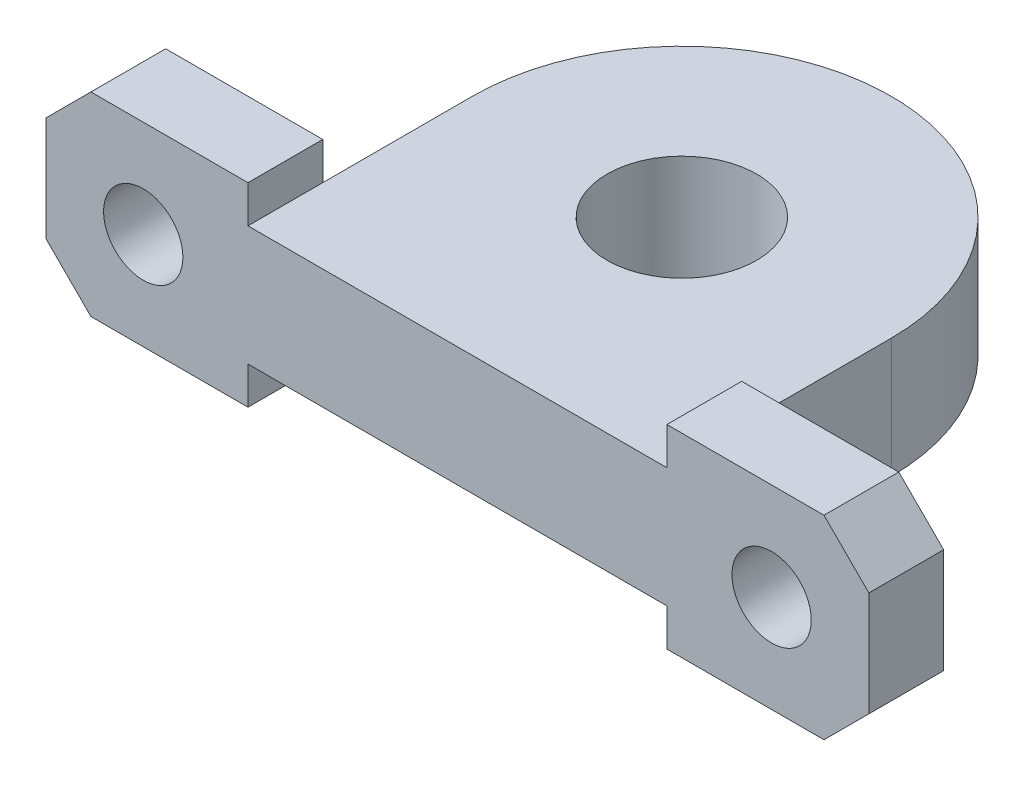
ISO-10303-21;
HEADER;
FILE_DESCRIPTION(('STEP AP214'),'2;1');
FILE_NAME('part.step','',(''),(''),'','','');
FILE_SCHEMA(('AUTOMOTIVE_DESIGN { 1 0 10303 214 1 1 1 1 }'));
ENDSEC;
DATA;
#1=APPLICATION_CONTEXT('core data for automotive mechanical design processes');
#2=APPLICATION_PROTOCOL_DEFINITION('international standard','automotive_design',2000,#1);
#3=PRODUCT_CONTEXT('',#1,'mechanical');
#4=PRODUCT('Part','Part','',(#3));
#5=PRODUCT_RELATED_PRODUCT_CATEGORY('part','',(#4));
#6=PRODUCT_DEFINITION_FORMATION('','',#4);
#7=PRODUCT_DEFINITION_CONTEXT('part definition',#1,'design');
#8=PRODUCT_DEFINITION('design','',#6,#7);
#9=PRODUCT_DEFINITION_SHAPE('','',#8);
#10=(LENGTH_UNIT() NAMED_UNIT(*) SI_UNIT(.MILLI.,.METRE.));
#11=(NAMED_UNIT(*) PLANE_ANGLE_UNIT() SI_UNIT($,.RADIAN.));
#12=(NAMED_UNIT(*) SI_UNIT($,.STERADIAN.) SOLID_ANGLE_UNIT());
#13=UNCERTAINTY_MEASURE_WITH_UNIT(LENGTH_MEASURE(1.E-05),#10,'distance_accuracy_value','');
#14=(GEOMETRIC_REPRESENTATION_CONTEXT(3) GLOBAL_UNCERTAINTY_ASSIGNED_CONTEXT((#13)) GLOBAL_UNIT_ASSIGNED_CONTEXT((#10,
#11,#12)) REPRESENTATION_CONTEXT('',''));
#15=CARTESIAN_POINT('',(0.,0.,0.));
#16=DIRECTION('',(0.,0.,1.));
#17=DIRECTION('',(1.,0.,0.));
#18=AXIS2_PLACEMENT_3D('',#15,#16,#17);
#19=CARTESIAN_POINT('',(0.,0.,0.));
#20=DIRECTION('',(0.,0.,1.));
#21=DIRECTION('',(1.,0.,0.));
#22=AXIS2_PLACEMENT_3D('',#19,#20,#21);
#23=PLANE('',#22);
#24=CARTESIAN_POINT('',(21.,4.,0.));
#25=DIRECTION('',(0.,0.,1.));
#26=DIRECTION('',(1.,0.,0.));
#27=AXIS2_PLACEMENT_3D('',#24,#25,#26);
#28=CIRCLE('',#27,2.65);
#29=CARTESIAN_POINT('',(23.65,4.,0.));
#30=VERTEX_POINT('',#29);
#31=EDGE_CURVE('E208',#30,#30,#28,.F.);
#32=ORIENTED_EDGE('',*,*,#31,.F.);
#33=EDGE_LOOP('',(#32));
#34=FACE_BOUND('',#33,.T.);
#35=DIRECTION('',(0.,-1.,0.));
#36=VECTOR('',#35,1.);
#37=CARTESIAN_POINT('',(14.,0.,0.));
#38=LINE('',#37,#36);
#39=CARTESIAN_POINT('',(14.,8.,0.));
#40=VERTEX_POINT('',#39);
#41=CARTESIAN_POINT('',(14.,0.,0.));
#42=VERTEX_POINT('',#41);
#43=EDGE_CURVE('E11',#40,#42,#38,.T.);
#44=ORIENTED_EDGE('',*,*,#43,.F.);
#45=DIRECTION('',(0.,-1.,0.));
#46=VECTOR('',#45,1.);
#47=CARTESIAN_POINT('',(14.,0.,0.));
#48=LINE('',#47,#46);
#49=CARTESIAN_POINT('',(14.,10.5,0.));
#50=VERTEX_POINT('',#49);
#51=EDGE_CURVE('E187',#50,#40,#48,.T.);
#52=ORIENTED_EDGE('',*,*,#51,.F.);
#53=DIRECTION('',(-1.,0.,0.));
#54=VECTOR('',#53,1.);
#55=CARTESIAN_POINT('',(0.,10.5,0.));
#56=LINE('',#55,#54);
#57=CARTESIAN_POINT('',(24.5,10.5,0.));
#58=VERTEX_POINT('',#57);
#59=EDGE_CURVE('E256',#58,#50,#56,.T.);
#60=ORIENTED_EDGE('',*,*,#59,.F.);
#61=DIRECTION('',(0.707106781186547,-0.707106781186548,0.));
#62=VECTOR('',#61,1.);
#63=CARTESIAN_POINT('',(24.5,10.5,0.));
#64=LINE('',#63,#62);
#65=CARTESIAN_POINT('',(27.5,7.49999999999999,0.));
#66=VERTEX_POINT('',#65);
#67=EDGE_CURVE('E291',#58,#66,#64,.T.);
#68=ORIENTED_EDGE('',*,*,#67,.T.);
#69=DIRECTION('',(0.,-1.,0.));
#70=VECTOR('',#69,1.);
#71=CARTESIAN_POINT('',(27.5,0.,0.));
#72=LINE('',#71,#70);
#73=CARTESIAN_POINT('',(27.5,0.499999999999985,0.));
#74=VERTEX_POINT('',#73);
#75=EDGE_CURVE('E253',#66,#74,#72,.T.);
#76=ORIENTED_EDGE('',*,*,#75,.T.);
#77=DIRECTION('',(0.707106781186549,0.707106781186546,0.));
#78=VECTOR('',#77,1.);
#79=CARTESIAN_POINT('',(27.5,0.499999999999985,0.));
#80=LINE('',#79,#78);
#81=CARTESIAN_POINT('',(24.5,-2.5,0.));
#82=VERTEX_POINT('',#81);
#83=EDGE_CURVE('E289',#74,#82,#80,.F.);
#84=ORIENTED_EDGE('',*,*,#83,.T.);
#85=DIRECTION('',(-1.,0.,0.));
#86=VECTOR('',#85,1.);
#87=CARTESIAN_POINT('',(0.,-2.5,0.));
#88=LINE('',#87,#86);
#89=CARTESIAN_POINT('',(14.,-2.5,0.));
#90=VERTEX_POINT('',#89);
#91=EDGE_CURVE('E251',#82,#90,#88,.T.);
#92=ORIENTED_EDGE('',*,*,#91,.T.);
#93=EDGE_CURVE('E240',#42,#90,#48,.T.);
#94=ORIENTED_EDGE('',*,*,#93,.F.);
#95=EDGE_LOOP('',(#44,#52,#60,#68,#76,#84,#92,#94));
#96=FACE_BOUND('',#95,.T.);
#97=ADVANCED_FACE('F38',(#34,#96),#23,.F.);
#98=CARTESIAN_POINT('',(-21.,4.,0.));
#99=DIRECTION('',(0.,0.,1.));
#100=DIRECTION('',(1.,0.,0.));
#101=AXIS2_PLACEMENT_3D('',#98,#99,#100);
#102=CIRCLE('',#101,2.65);
#103=CARTESIAN_POINT('',(-18.35,4.,0.));
#104=VERTEX_POINT('',#103);
#105=EDGE_CURVE('E258',#104,#104,#102,.T.);
#106=ORIENTED_EDGE('',*,*,#105,.T.);
#107=EDGE_LOOP('',(#106));
#108=FACE_BOUND('',#107,.T.);
#109=DIRECTION('',(0.,1.,0.));
#110=VECTOR('',#109,1.);
#111=CARTESIAN_POINT('',(-14.,0.,0.));
#112=LINE('',#111,#110);
#113=CARTESIAN_POINT('',(-14.,0.,0.));
#114=VERTEX_POINT('',#113);
#115=CARTESIAN_POINT('',(-14.,8.,0.));
#116=VERTEX_POINT('',#115);
#117=EDGE_CURVE('E48',#114,#116,#112,.T.);
#118=ORIENTED_EDGE('',*,*,#117,.F.);
#119=DIRECTION('',(0.,-1.,0.));
#120=VECTOR('',#119,1.);
#121=CARTESIAN_POINT('',(-14.,0.,0.));
#122=LINE('',#121,#120);
#123=CARTESIAN_POINT('',(-14.,-2.5,0.));
#124=VERTEX_POINT('',#123);
#125=EDGE_CURVE('E244',#114,#124,#122,.T.);
#126=ORIENTED_EDGE('',*,*,#125,.T.);
#127=DIRECTION('',(1.,0.,0.));
#128=VECTOR('',#127,1.);
#129=CARTESIAN_POINT('',(0.,-2.5,0.));
#130=LINE('',#129,#128);
#131=CARTESIAN_POINT('',(-24.5,-2.5,0.));
#132=VERTEX_POINT('',#131);
#133=EDGE_CURVE('E249',#132,#124,#130,.T.);
#134=ORIENTED_EDGE('',*,*,#133,.F.);
#135=DIRECTION('',(0.707106781186546,-0.707106781186549,0.));
#136=VECTOR('',#135,1.);
#137=CARTESIAN_POINT('',(-24.5,-2.5,0.));
#138=LINE('',#137,#136);
#139=CARTESIAN_POINT('',(-27.5,0.5,0.));
#140=VERTEX_POINT('',#139);
#141=EDGE_CURVE('E287',#132,#140,#138,.F.);
#142=ORIENTED_EDGE('',*,*,#141,.T.);
#143=DIRECTION('',(0.,-1.,0.));
#144=VECTOR('',#143,1.);
#145=CARTESIAN_POINT('',(-27.5,0.,0.));
#146=LINE('',#145,#144);
#147=CARTESIAN_POINT('',(-27.5,7.50000000000001,0.));
#148=VERTEX_POINT('',#147);
#149=EDGE_CURVE('E246',#148,#140,#146,.T.);
#150=ORIENTED_EDGE('',*,*,#149,.F.);
#151=DIRECTION('',(0.707106781186549,0.707106781186546,0.));
#152=VECTOR('',#151,1.);
#153=CARTESIAN_POINT('',(-27.5,7.50000000000001,0.));
#154=LINE('',#153,#152);
#155=CARTESIAN_POINT('',(-24.5,10.5,0.));
#156=VERTEX_POINT('',#155);
#157=EDGE_CURVE('E285',#148,#156,#154,.T.);
#158=ORIENTED_EDGE('',*,*,#157,.T.);
#159=DIRECTION('',(1.,0.,0.));
#160=VECTOR('',#159,1.);
#161=CARTESIAN_POINT('',(0.,10.5,0.));
#162=LINE('',#161,#160);
#163=CARTESIAN_POINT('',(-14.,10.5,0.));
#164=VERTEX_POINT('',#163);
#165=EDGE_CURVE('E243',#156,#164,#162,.T.);
#166=ORIENTED_EDGE('',*,*,#165,.T.);
#167=EDGE_CURVE('E239',#164,#116,#122,.T.);
#168=ORIENTED_EDGE('',*,*,#167,.T.);
#169=EDGE_LOOP('',(#118,#126,#134,#142,#150,#158,#166,#168));
#170=FACE_BOUND('',#169,.T.);
#171=ADVANCED_FACE('F357',(#108,#170),#23,.F.);
#172=CARTESIAN_POINT('',(14.,0.,5.));
#173=DIRECTION('',(1.,0.,0.));
#174=DIRECTION('',(0.,0.,-1.));
#175=AXIS2_PLACEMENT_3D('',#172,#173,#174);
#176=PLANE('',#175);
#177=ORIENTED_EDGE('',*,*,#51,.T.);
#178=DIRECTION('',(0.,0.,-1.));
#179=VECTOR('',#178,1.);
#180=CARTESIAN_POINT('',(14.,8.,5.));
#181=LINE('',#180,#179);
#182=CARTESIAN_POINT('',(14.,8.,5.));
#183=VERTEX_POINT('',#182);
#184=EDGE_CURVE('E175',#183,#40,#181,.T.);
#185=ORIENTED_EDGE('',*,*,#184,.F.);
#186=DIRECTION('',(0.,-1.,0.));
#187=VECTOR('',#186,1.);
#188=CARTESIAN_POINT('',(14.,0.,5.));
#189=LINE('',#188,#187);
#190=CARTESIAN_POINT('',(14.,10.5,5.));
#191=VERTEX_POINT('',#190);
#192=EDGE_CURVE('E204',#191,#183,#189,.T.);
#193=ORIENTED_EDGE('',*,*,#192,.F.);
#194=DIRECTION('',(0.,0.,-1.));
#195=VECTOR('',#194,1.);
#196=CARTESIAN_POINT('',(14.,10.5,5.));
#197=LINE('',#196,#195);
#198=EDGE_CURVE('E237',#191,#50,#197,.T.);
#199=ORIENTED_EDGE('',*,*,#198,.T.);
#200=EDGE_LOOP('',(#177,#185,#193,#199));
#201=FACE_BOUND('',#200,.T.);
#202=ADVANCED_FACE('F338',(#201),#176,.F.);
#203=CARTESIAN_POINT('',(0.,8.,5.));
#204=DIRECTION('',(0.,-1.,0.));
#205=DIRECTION('',(0.,0.,-1.));
#206=AXIS2_PLACEMENT_3D('',#203,#204,#205);
#207=PLANE('',#206);
#208=CARTESIAN_POINT('',(0.,8.,-10.));
#209=DIRECTION('',(0.,1.,0.));
#210=DIRECTION('',(0.,0.,1.));
#211=AXIS2_PLACEMENT_3D('',#208,#209,#210);
#212=CIRCLE('',#211,5.);
#213=CARTESIAN_POINT('',(0.,8.,-5.));
#214=VERTEX_POINT('',#213);
#215=EDGE_CURVE('E416',#214,#214,#212,.T.);
#216=ORIENTED_EDGE('',*,*,#215,.F.);
#217=EDGE_LOOP('',(#216));
#218=FACE_BOUND('',#217,.T.);
#219=ORIENTED_EDGE('',*,*,#184,.T.);
#220=DIRECTION('',(0.,0.,-1.));
#221=VECTOR('',#220,1.);
#222=CARTESIAN_POINT('',(14.,8.,4.99999999999999));
#223=LINE('',#222,#221);
#224=CARTESIAN_POINT('',(14.,8.,-10.));
#225=VERTEX_POINT('',#224);
#226=EDGE_CURVE('E167',#40,#225,#223,.T.);
#227=ORIENTED_EDGE('',*,*,#226,.T.);
#228=CARTESIAN_POINT('',(0.,8.,-10.));
#229=DIRECTION('',(0.,1.,0.));
#230=DIRECTION('',(0.,0.,-1.));
#231=AXIS2_PLACEMENT_3D('',#228,#229,#230);
#232=CIRCLE('',#231,14.);
#233=CARTESIAN_POINT('',(-14.,8.,-10.));
#234=VERTEX_POINT('',#233);
#235=EDGE_CURVE('E172',#225,#234,#232,.T.);
#236=ORIENTED_EDGE('',*,*,#235,.T.);
#237=DIRECTION('',(0.,0.,1.));
#238=VECTOR('',#237,1.);
#239=CARTESIAN_POINT('',(-14.,8.,5.));
#240=LINE('',#239,#238);
#241=EDGE_CURVE('E193',#234,#116,#240,.T.);
#242=ORIENTED_EDGE('',*,*,#241,.T.);
#243=DIRECTION('',(0.,0.,-1.));
#244=VECTOR('',#243,1.);
#245=CARTESIAN_POINT('',(-14.,8.,5.));
#246=LINE('',#245,#244);
#247=CARTESIAN_POINT('',(-14.,8.,5.));
#248=VERTEX_POINT('',#247);
#249=EDGE_CURVE('E279',#248,#116,#246,.T.);
#250=ORIENTED_EDGE('',*,*,#249,.F.);
#251=DIRECTION('',(-1.,0.,0.));
#252=VECTOR('',#251,1.);
#253=CARTESIAN_POINT('',(0.,8.,5.));
#254=LINE('',#253,#252);
#255=EDGE_CURVE('E207',#183,#248,#254,.T.);
#256=ORIENTED_EDGE('',*,*,#255,.F.);
#257=EDGE_LOOP('',(#219,#227,#236,#242,#250,#256));
#258=FACE_BOUND('',#257,.T.);
#259=ADVANCED_FACE('F169',(#218,#258),#207,.F.);
#260=CARTESIAN_POINT('',(-14.,0.,5.));
#261=DIRECTION('',(1.,0.,0.));
#262=DIRECTION('',(0.,0.,-1.));
#263=AXIS2_PLACEMENT_3D('',#260,#261,#262);
#264=PLANE('',#263);
#265=ORIENTED_EDGE('',*,*,#167,.F.);
#266=DIRECTION('',(0.,0.,-1.));
#267=VECTOR('',#266,1.);
#268=CARTESIAN_POINT('',(-14.,10.5,5.));
#269=LINE('',#268,#267);
#270=CARTESIAN_POINT('',(-14.,10.5,5.));
#271=VERTEX_POINT('',#270);
#272=EDGE_CURVE('E276',#271,#164,#269,.T.);
#273=ORIENTED_EDGE('',*,*,#272,.F.);
#274=DIRECTION('',(0.,-1.,0.));
#275=VECTOR('',#274,1.);
#276=CARTESIAN_POINT('',(-14.,0.,5.));
#277=LINE('',#276,#275);
#278=EDGE_CURVE('E211',#271,#248,#277,.T.);
#279=ORIENTED_EDGE('',*,*,#278,.T.);
#280=ORIENTED_EDGE('',*,*,#249,.T.);
#281=EDGE_LOOP('',(#265,#273,#279,#280));
#282=FACE_BOUND('',#281,.T.);
#283=ADVANCED_FACE('F328',(#282),#264,.T.);
#284=CARTESIAN_POINT('',(0.,10.5,5.));
#285=DIRECTION('',(0.,1.,0.));
#286=DIRECTION('',(0.,0.,1.));
#287=AXIS2_PLACEMENT_3D('',#284,#285,#286);
#288=PLANE('',#287);
#289=ORIENTED_EDGE('',*,*,#165,.F.);
#290=DIRECTION('',(0.,0.,1.));
#291=VECTOR('',#290,1.);
#292=CARTESIAN_POINT('',(-24.5,10.5,5.));
#293=LINE('',#292,#291);
#294=CARTESIAN_POINT('',(-24.5,10.5,5.));
#295=VERTEX_POINT('',#294);
#296=EDGE_CURVE('E314',#156,#295,#293,.T.);
#297=ORIENTED_EDGE('',*,*,#296,.T.);
#298=DIRECTION('',(1.,0.,0.));
#299=VECTOR('',#298,1.);
#300=CARTESIAN_POINT('',(0.,10.5,5.));
#301=LINE('',#300,#299);
#302=EDGE_CURVE('E214',#295,#271,#301,.T.);
#303=ORIENTED_EDGE('',*,*,#302,.T.);
#304=ORIENTED_EDGE('',*,*,#272,.T.);
#305=EDGE_LOOP('',(#289,#297,#303,#304));
#306=FACE_BOUND('',#305,.T.);
#307=ADVANCED_FACE('F424',(#306),#288,.T.);
#308=CARTESIAN_POINT('',(-27.5,0.,5.));
#309=DIRECTION('',(1.,0.,0.));
#310=DIRECTION('',(0.,0.,-1.));
#311=AXIS2_PLACEMENT_3D('',#308,#309,#310);
#312=PLANE('',#311);
#313=ORIENTED_EDGE('',*,*,#149,.T.);
#314=DIRECTION('',(0.,0.,1.));
#315=VECTOR('',#314,1.);
#316=CARTESIAN_POINT('',(-27.5,0.5,5.));
#317=LINE('',#316,#315);
#318=CARTESIAN_POINT('',(-27.5,0.5,5.));
#319=VERTEX_POINT('',#318);
#320=EDGE_CURVE('E312',#140,#319,#317,.T.);
#321=ORIENTED_EDGE('',*,*,#320,.T.);
#322=DIRECTION('',(0.,-1.,0.));
#323=VECTOR('',#322,1.);
#324=CARTESIAN_POINT('',(-27.5,0.,5.));
#325=LINE('',#324,#323);
#326=CARTESIAN_POINT('',(-27.5,7.50000000000001,5.));
#327=VERTEX_POINT('',#326);
#328=EDGE_CURVE('E217',#327,#319,#325,.T.);
#329=ORIENTED_EDGE('',*,*,#328,.F.);
#330=DIRECTION('',(0.,0.,-1.));
#331=VECTOR('',#330,1.);
#332=CARTESIAN_POINT('',(-27.5,7.50000000000001,0.));
#333=LINE('',#332,#331);
#334=EDGE_CURVE('E309',#327,#148,#333,.T.);
#335=ORIENTED_EDGE('',*,*,#334,.T.);
#336=EDGE_LOOP('',(#313,#321,#329,#335));
#337=FACE_BOUND('',#336,.T.);
#338=ADVANCED_FACE('F452',(#337),#312,.F.);
#339=CARTESIAN_POINT('',(0.,-2.5,5.));
#340=DIRECTION('',(0.,1.,0.));
#341=DIRECTION('',(0.,0.,1.));
#342=AXIS2_PLACEMENT_3D('',#339,#340,#341);
#343=PLANE('',#342);
#344=DIRECTION('',(1.,0.,0.));
#345=VECTOR('',#344,1.);
#346=CARTESIAN_POINT('',(0.,-2.5,5.));
#347=LINE('',#346,#345);
#348=CARTESIAN_POINT('',(-24.5,-2.5,5.));
#349=VERTEX_POINT('',#348);
#350=CARTESIAN_POINT('',(-14.,-2.5,5.));
#351=VERTEX_POINT('',#350);
#352=EDGE_CURVE('E219',#349,#351,#347,.T.);
#353=ORIENTED_EDGE('',*,*,#352,.F.);
#354=DIRECTION('',(0.,0.,-1.));
#355=VECTOR('',#354,1.);
#356=CARTESIAN_POINT('',(-24.5,-2.5,5.));
#357=LINE('',#356,#355);
#358=EDGE_CURVE('E306',#349,#132,#357,.T.);
#359=ORIENTED_EDGE('',*,*,#358,.T.);
#360=ORIENTED_EDGE('',*,*,#133,.T.);
#361=DIRECTION('',(0.,0.,-1.));
#362=VECTOR('',#361,1.);
#363=CARTESIAN_POINT('',(-14.,-2.5,5.));
#364=LINE('',#363,#362);
#365=EDGE_CURVE('E273',#351,#124,#364,.T.);
#366=ORIENTED_EDGE('',*,*,#365,.F.);
#367=EDGE_LOOP('',(#353,#359,#360,#366));
#368=FACE_BOUND('',#367,.T.);
#369=ADVANCED_FACE('F355',(#368),#343,.F.);
#370=ORIENTED_EDGE('',*,*,#125,.F.);
#371=DIRECTION('',(0.,0.,-1.));
#372=VECTOR('',#371,1.);
#373=CARTESIAN_POINT('',(-14.,0.,5.));
#374=LINE('',#373,#372);
#375=CARTESIAN_POINT('',(-14.,0.,5.));
#376=VERTEX_POINT('',#375);
#377=EDGE_CURVE('E270',#376,#114,#374,.T.);
#378=ORIENTED_EDGE('',*,*,#377,.F.);
#379=EDGE_CURVE('E215',#376,#351,#277,.T.);
#380=ORIENTED_EDGE('',*,*,#379,.T.);
#381=ORIENTED_EDGE('',*,*,#365,.T.);
#382=EDGE_LOOP('',(#370,#378,#380,#381));
#383=FACE_BOUND('',#382,.T.);
#384=ADVANCED_FACE('F350',(#383),#264,.T.);
#385=CARTESIAN_POINT('',(0.,0.,5.));
#386=DIRECTION('',(0.,-1.,0.));
#387=DIRECTION('',(0.,0.,-1.));
#388=AXIS2_PLACEMENT_3D('',#385,#386,#387);
#389=PLANE('',#388);
#390=CARTESIAN_POINT('',(0.,0.,-10.));
#391=DIRECTION('',(0.,-1.,0.));
#392=DIRECTION('',(0.,0.,-1.));
#393=AXIS2_PLACEMENT_3D('',#390,#391,#392);
#394=CIRCLE('',#393,5.);
#395=CARTESIAN_POINT('',(0.,0.,-15.));
#396=VERTEX_POINT('',#395);
#397=EDGE_CURVE('E43',#396,#396,#394,.T.);
#398=ORIENTED_EDGE('',*,*,#397,.F.);
#399=EDGE_LOOP('',(#398));
#400=FACE_BOUND('',#399,.T.);
#401=ORIENTED_EDGE('',*,*,#377,.T.);
#402=DIRECTION('',(0.,0.,1.));
#403=VECTOR('',#402,1.);
#404=CARTESIAN_POINT('',(-14.,0.,5.));
#405=LINE('',#404,#403);
#406=CARTESIAN_POINT('',(-14.,0.,-10.));
#407=VERTEX_POINT('',#406);
#408=EDGE_CURVE('E178',#407,#114,#405,.T.);
#409=ORIENTED_EDGE('',*,*,#408,.F.);
#410=CARTESIAN_POINT('',(0.,0.,-10.));
#411=DIRECTION('',(0.,1.,0.));
#412=DIRECTION('',(0.,0.,-1.));
#413=AXIS2_PLACEMENT_3D('',#410,#411,#412);
#414=CIRCLE('',#413,14.);
#415=CARTESIAN_POINT('',(14.,0.,-10.));
#416=VERTEX_POINT('',#415);
#417=EDGE_CURVE('E199',#416,#407,#414,.T.);
#418=ORIENTED_EDGE('',*,*,#417,.F.);
#419=DIRECTION('',(0.,0.,-1.));
#420=VECTOR('',#419,1.);
#421=CARTESIAN_POINT('',(14.,0.,4.99999999999999));
#422=LINE('',#421,#420);
#423=EDGE_CURVE('E184',#42,#416,#422,.T.);
#424=ORIENTED_EDGE('',*,*,#423,.F.);
#425=DIRECTION('',(0.,0.,-1.));
#426=VECTOR('',#425,1.);
#427=CARTESIAN_POINT('',(14.,0.,5.));
#428=LINE('',#427,#426);
#429=CARTESIAN_POINT('',(14.,0.,5.));
#430=VERTEX_POINT('',#429);
#431=EDGE_CURVE('E268',#430,#42,#428,.T.);
#432=ORIENTED_EDGE('',*,*,#431,.F.);
#433=DIRECTION('',(-1.,0.,0.));
#434=VECTOR('',#433,1.);
#435=CARTESIAN_POINT('',(0.,0.,5.));
#436=LINE('',#435,#434);
#437=EDGE_CURVE('E221',#430,#376,#436,.T.);
#438=ORIENTED_EDGE('',*,*,#437,.T.);
#439=EDGE_LOOP('',(#401,#409,#418,#424,#432,#438));
#440=FACE_BOUND('',#439,.T.);
#441=ADVANCED_FACE('F345',(#400,#440),#389,.T.);
#442=ORIENTED_EDGE('',*,*,#93,.T.);
#443=DIRECTION('',(0.,0.,-1.));
#444=VECTOR('',#443,1.);
#445=CARTESIAN_POINT('',(14.,-2.5,5.));
#446=LINE('',#445,#444);
#447=CARTESIAN_POINT('',(14.,-2.5,5.));
#448=VERTEX_POINT('',#447);
#449=EDGE_CURVE('E265',#448,#90,#446,.T.);
#450=ORIENTED_EDGE('',*,*,#449,.F.);
#451=EDGE_CURVE('E209',#430,#448,#189,.T.);
#452=ORIENTED_EDGE('',*,*,#451,.F.);
#453=ORIENTED_EDGE('',*,*,#431,.T.);
#454=EDGE_LOOP('',(#442,#450,#452,#453));
#455=FACE_BOUND('',#454,.T.);
#456=ADVANCED_FACE('F360',(#455),#176,.F.);
#457=CARTESIAN_POINT('',(0.,-2.5,5.));
#458=DIRECTION('',(0.,-1.,0.));
#459=DIRECTION('',(0.,0.,-1.));
#460=AXIS2_PLACEMENT_3D('',#457,#458,#459);
#461=PLANE('',#460);
#462=ORIENTED_EDGE('',*,*,#91,.F.);
#463=DIRECTION('',(0.,0.,1.));
#464=VECTOR('',#463,1.);
#465=CARTESIAN_POINT('',(24.5,-2.5,5.));
#466=LINE('',#465,#464);
#467=CARTESIAN_POINT('',(24.5,-2.5,5.));
#468=VERTEX_POINT('',#467);
#469=EDGE_CURVE('E55',#82,#468,#466,.T.);
#470=ORIENTED_EDGE('',*,*,#469,.T.);
#471=DIRECTION('',(-1.,0.,0.));
#472=VECTOR('',#471,1.);
#473=CARTESIAN_POINT('',(0.,-2.5,5.));
#474=LINE('',#473,#472);
#475=EDGE_CURVE('E224',#468,#448,#474,.T.);
#476=ORIENTED_EDGE('',*,*,#475,.T.);
#477=ORIENTED_EDGE('',*,*,#449,.T.);
#478=EDGE_LOOP('',(#462,#470,#476,#477));
#479=FACE_BOUND('',#478,.T.);
#480=ADVANCED_FACE('F472',(#479),#461,.T.);
#481=CARTESIAN_POINT('',(27.5,0.,5.));
#482=DIRECTION('',(1.,0.,0.));
#483=DIRECTION('',(0.,0.,-1.));
#484=AXIS2_PLACEMENT_3D('',#481,#482,#483);
#485=PLANE('',#484);
#486=ORIENTED_EDGE('',*,*,#75,.F.);
#487=DIRECTION('',(0.,0.,1.));
#488=VECTOR('',#487,1.);
#489=CARTESIAN_POINT('',(27.5,7.49999999999999,5.));
#490=LINE('',#489,#488);
#491=CARTESIAN_POINT('',(27.5,7.49999999999999,5.));
#492=VERTEX_POINT('',#491);
#493=EDGE_CURVE('E296',#66,#492,#490,.T.);
#494=ORIENTED_EDGE('',*,*,#493,.T.);
#495=DIRECTION('',(0.,-1.,0.));
#496=VECTOR('',#495,1.);
#497=CARTESIAN_POINT('',(27.5,0.,5.));
#498=LINE('',#497,#496);
#499=CARTESIAN_POINT('',(27.5,0.499999999999985,5.));
#500=VERTEX_POINT('',#499);
#501=EDGE_CURVE('E226',#492,#500,#498,.T.);
#502=ORIENTED_EDGE('',*,*,#501,.T.);
#503=DIRECTION('',(0.,0.,-1.));
#504=VECTOR('',#503,1.);
#505=CARTESIAN_POINT('',(27.5,0.499999999999985,5.));
#506=LINE('',#505,#504);
#507=EDGE_CURVE('E293',#500,#74,#506,.T.);
#508=ORIENTED_EDGE('',*,*,#507,.T.);
#509=EDGE_LOOP('',(#486,#494,#502,#508));
#510=FACE_BOUND('',#509,.T.);
#511=ADVANCED_FACE('F368',(#510),#485,.T.);
#512=CARTESIAN_POINT('',(-21.,4.,5.));
#513=DIRECTION('',(0.,0.,-1.));
#514=DIRECTION('',(-1.,0.,0.));
#515=AXIS2_PLACEMENT_3D('',#512,#513,#514);
#516=CYLINDRICAL_SURFACE('',#515,2.65);
#517=CARTESIAN_POINT('',(-21.,4.,5.));
#518=DIRECTION('',(0.,0.,1.));
#519=DIRECTION('',(1.,0.,0.));
#520=AXIS2_PLACEMENT_3D('',#517,#518,#519);
#521=CIRCLE('',#520,2.65);
#522=CARTESIAN_POINT('',(-18.35,4.,5.));
#523=VERTEX_POINT('',#522);
#524=EDGE_CURVE('E231',#523,#523,#521,.T.);
#525=ORIENTED_EDGE('',*,*,#524,.T.);
#526=EDGE_LOOP('',(#525));
#527=FACE_BOUND('',#526,.T.);
#528=ORIENTED_EDGE('',*,*,#105,.F.);
#529=EDGE_LOOP('',(#528));
#530=FACE_BOUND('',#529,.T.);
#531=ADVANCED_FACE('F378',(#527,#530),#516,.F.);
#532=CARTESIAN_POINT('',(0.,10.5,5.));
#533=DIRECTION('',(0.,-1.,0.));
#534=DIRECTION('',(0.,0.,-1.));
#535=AXIS2_PLACEMENT_3D('',#532,#533,#534);
#536=PLANE('',#535);
#537=DIRECTION('',(-1.,0.,0.));
#538=VECTOR('',#537,1.);
#539=CARTESIAN_POINT('',(0.,10.5,5.));
#540=LINE('',#539,#538);
#541=CARTESIAN_POINT('',(24.5,10.5,5.));
#542=VERTEX_POINT('',#541);
#543=EDGE_CURVE('E229',#542,#191,#540,.T.);
#544=ORIENTED_EDGE('',*,*,#543,.F.);
#545=DIRECTION('',(0.,0.,-1.));
#546=VECTOR('',#545,1.);
#547=CARTESIAN_POINT('',(24.5,10.5,0.));
#548=LINE('',#547,#546);
#549=EDGE_CURVE('E282',#542,#58,#548,.T.);
#550=ORIENTED_EDGE('',*,*,#549,.T.);
#551=ORIENTED_EDGE('',*,*,#59,.T.);
#552=ORIENTED_EDGE('',*,*,#198,.F.);
#553=EDGE_LOOP('',(#544,#550,#551,#552));
#554=FACE_BOUND('',#553,.T.);
#555=ADVANCED_FACE('F375',(#554),#536,.F.);
#556=CARTESIAN_POINT('',(21.,4.,5.));
#557=DIRECTION('',(0.,0.,-1.));
#558=DIRECTION('',(-1.,0.,0.));
#559=AXIS2_PLACEMENT_3D('',#556,#557,#558);
#560=CYLINDRICAL_SURFACE('',#559,2.65);
#561=CARTESIAN_POINT('',(21.,4.,5.));
#562=DIRECTION('',(0.,0.,1.));
#563=DIRECTION('',(1.,0.,0.));
#564=AXIS2_PLACEMENT_3D('',#561,#562,#563);
#565=CIRCLE('',#564,2.65);
#566=CARTESIAN_POINT('',(23.65,4.,5.));
#567=VERTEX_POINT('',#566);
#568=EDGE_CURVE('E234',#567,#567,#565,.F.);
#569=ORIENTED_EDGE('',*,*,#568,.F.);
#570=EDGE_LOOP('',(#569));
#571=FACE_BOUND('',#570,.T.);
#572=ORIENTED_EDGE('',*,*,#31,.T.);
#573=EDGE_LOOP('',(#572));
#574=FACE_BOUND('',#573,.T.);
#575=ADVANCED_FACE('F377',(#571,#574),#560,.F.);
#576=CARTESIAN_POINT('',(0.,0.,5.));
#577=DIRECTION('',(0.,0.,1.));
#578=DIRECTION('',(1.,0.,0.));
#579=AXIS2_PLACEMENT_3D('',#576,#577,#578);
#580=PLANE('',#579);
#581=ORIENTED_EDGE('',*,*,#437,.F.);
#582=ORIENTED_EDGE('',*,*,#451,.T.);
#583=ORIENTED_EDGE('',*,*,#475,.F.);
#584=DIRECTION('',(-0.707106781186549,-0.707106781186546,0.));
#585=VECTOR('',#584,1.);
#586=CARTESIAN_POINT('',(13.4999999999999,-13.5,5.));
#587=LINE('',#586,#585);
#588=EDGE_CURVE('E301',#468,#500,#587,.F.);
#589=ORIENTED_EDGE('',*,*,#588,.T.);
#590=ORIENTED_EDGE('',*,*,#501,.F.);
#591=DIRECTION('',(-0.707106781186547,0.707106781186548,0.));
#592=VECTOR('',#591,1.);
#593=CARTESIAN_POINT('',(17.5,17.5,5.));
#594=LINE('',#593,#592);
#595=EDGE_CURVE('E303',#492,#542,#594,.T.);
#596=ORIENTED_EDGE('',*,*,#595,.T.);
#597=ORIENTED_EDGE('',*,*,#543,.T.);
#598=ORIENTED_EDGE('',*,*,#192,.T.);
#599=ORIENTED_EDGE('',*,*,#255,.T.);
#600=ORIENTED_EDGE('',*,*,#278,.F.);
#601=ORIENTED_EDGE('',*,*,#302,.F.);
#602=DIRECTION('',(-0.707106781186549,-0.707106781186546,0.));
#603=VECTOR('',#602,1.);
#604=CARTESIAN_POINT('',(-17.4999999999999,17.5,5.));
#605=LINE('',#604,#603);
#606=EDGE_CURVE('E298',#295,#327,#605,.T.);
#607=ORIENTED_EDGE('',*,*,#606,.T.);
#608=ORIENTED_EDGE('',*,*,#328,.T.);
#609=DIRECTION('',(-0.707106781186546,0.707106781186549,0.));
#610=VECTOR('',#609,1.);
#611=CARTESIAN_POINT('',(-13.5000000000001,-13.5,5.));
#612=LINE('',#611,#610);
#613=EDGE_CURVE('E63',#319,#349,#612,.F.);
#614=ORIENTED_EDGE('',*,*,#613,.T.);
#615=ORIENTED_EDGE('',*,*,#352,.T.);
#616=ORIENTED_EDGE('',*,*,#379,.F.);
#617=EDGE_LOOP('',(#581,#582,#583,#589,#590,#596,#597,#598,#599,#600,#601,#607,#608,#614,#615,#616));
#618=FACE_BOUND('',#617,.T.);
#619=ORIENTED_EDGE('',*,*,#524,.F.);
#620=EDGE_LOOP('',(#619));
#621=FACE_BOUND('',#620,.T.);
#622=ORIENTED_EDGE('',*,*,#568,.T.);
#623=EDGE_LOOP('',(#622));
#624=FACE_BOUND('',#623,.T.);
#625=ADVANCED_FACE('F331',(#618,#621,#624),#580,.T.);
#626=CARTESIAN_POINT('',(24.5,10.5,5.));
#627=DIRECTION('',(0.707106781186548,0.707106781186547,0.));
#628=DIRECTION('',(0.,0.,1.));
#629=AXIS2_PLACEMENT_3D('',#626,#627,#628);
#630=PLANE('',#629);
#631=ORIENTED_EDGE('',*,*,#595,.F.);
#632=ORIENTED_EDGE('',*,*,#493,.F.);
#633=ORIENTED_EDGE('',*,*,#67,.F.);
#634=ORIENTED_EDGE('',*,*,#549,.F.);
#635=EDGE_LOOP('',(#631,#632,#633,#634));
#636=FACE_BOUND('',#635,.T.);
#637=ADVANCED_FACE('F373',(#636),#630,.T.);
#638=CARTESIAN_POINT('',(27.5,0.499999999999985,5.));
#639=DIRECTION('',(-0.707106781186546,0.707106781186549,0.));
#640=DIRECTION('',(0.,0.,-1.));
#641=AXIS2_PLACEMENT_3D('',#638,#639,#640);
#642=PLANE('',#641);
#643=ORIENTED_EDGE('',*,*,#588,.F.);
#644=ORIENTED_EDGE('',*,*,#469,.F.);
#645=ORIENTED_EDGE('',*,*,#83,.F.);
#646=ORIENTED_EDGE('',*,*,#507,.F.);
#647=EDGE_LOOP('',(#643,#644,#645,#646));
#648=FACE_BOUND('',#647,.T.);
#649=ADVANCED_FACE('F365',(#648),#642,.F.);
#650=CARTESIAN_POINT('',(-24.5,-2.5,5.));
#651=DIRECTION('',(0.707106781186549,0.707106781186546,0.));
#652=DIRECTION('',(0.,0.,-1.));
#653=AXIS2_PLACEMENT_3D('',#650,#651,#652);
#654=PLANE('',#653);
#655=ORIENTED_EDGE('',*,*,#613,.F.);
#656=ORIENTED_EDGE('',*,*,#320,.F.);
#657=ORIENTED_EDGE('',*,*,#141,.F.);
#658=ORIENTED_EDGE('',*,*,#358,.F.);
#659=EDGE_LOOP('',(#655,#656,#657,#658));
#660=FACE_BOUND('',#659,.T.);
#661=ADVANCED_FACE('F440',(#660),#654,.F.);
#662=CARTESIAN_POINT('',(-27.5,7.50000000000001,5.));
#663=DIRECTION('',(-0.707106781186546,0.707106781186549,0.));
#664=DIRECTION('',(0.,0.,1.));
#665=AXIS2_PLACEMENT_3D('',#662,#663,#664);
#666=PLANE('',#665);
#667=ORIENTED_EDGE('',*,*,#606,.F.);
#668=ORIENTED_EDGE('',*,*,#296,.F.);
#669=ORIENTED_EDGE('',*,*,#157,.F.);
#670=ORIENTED_EDGE('',*,*,#334,.F.);
#671=EDGE_LOOP('',(#667,#668,#669,#670));
#672=FACE_BOUND('',#671,.T.);
#673=ADVANCED_FACE('F41',(#672),#666,.T.);
#674=CARTESIAN_POINT('',(14.,8.,4.99999999999999));
#675=DIRECTION('',(-1.,0.,0.));
#676=DIRECTION('',(0.,0.,1.));
#677=AXIS2_PLACEMENT_3D('',#674,#675,#676);
#678=PLANE('',#677);
#679=ORIENTED_EDGE('',*,*,#226,.F.);
#680=ORIENTED_EDGE('',*,*,#43,.T.);
#681=ORIENTED_EDGE('',*,*,#423,.T.);
#682=DIRECTION('',(0.,-1.,0.));
#683=VECTOR('',#682,1.);
#684=CARTESIAN_POINT('',(14.,8.,-10.));
#685=LINE('',#684,#683);
#686=EDGE_CURVE('E181',#225,#416,#685,.T.);
#687=ORIENTED_EDGE('',*,*,#686,.F.);
#688=EDGE_LOOP('',(#679,#680,#681,#687));
#689=FACE_BOUND('',#688,.T.);
#690=ADVANCED_FACE('F182',(#689),#678,.F.);
#691=CARTESIAN_POINT('',(-14.,8.,5.));
#692=DIRECTION('',(1.,0.,0.));
#693=DIRECTION('',(0.,0.,-1.));
#694=AXIS2_PLACEMENT_3D('',#691,#692,#693);
#695=PLANE('',#694);
#696=ORIENTED_EDGE('',*,*,#408,.T.);
#697=ORIENTED_EDGE('',*,*,#117,.T.);
#698=ORIENTED_EDGE('',*,*,#241,.F.);
#699=DIRECTION('',(0.,-1.,0.));
#700=VECTOR('',#699,1.);
#701=CARTESIAN_POINT('',(-14.,8.,-10.));
#702=LINE('',#701,#700);
#703=EDGE_CURVE('E188',#234,#407,#702,.T.);
#704=ORIENTED_EDGE('',*,*,#703,.T.);
#705=EDGE_LOOP('',(#696,#697,#698,#704));
#706=FACE_BOUND('',#705,.T.);
#707=ADVANCED_FACE('F319',(#706),#695,.F.);
#708=CARTESIAN_POINT('',(0.,8.,-10.));
#709=DIRECTION('',(0.,-1.,0.));
#710=DIRECTION('',(0.,0.,-1.));
#711=AXIS2_PLACEMENT_3D('',#708,#709,#710);
#712=CYLINDRICAL_SURFACE('',#711,14.);
#713=ORIENTED_EDGE('',*,*,#417,.T.);
#714=ORIENTED_EDGE('',*,*,#703,.F.);
#715=ORIENTED_EDGE('',*,*,#235,.F.);
#716=ORIENTED_EDGE('',*,*,#686,.T.);
#717=EDGE_LOOP('',(#713,#714,#715,#716));
#718=FACE_BOUND('',#717,.T.);
#719=ADVANCED_FACE('F190',(#718),#712,.T.);
#720=CARTESIAN_POINT('',(0.,-2.5,-10.));
#721=DIRECTION('',(0.,1.,0.));
#722=DIRECTION('',(0.,0.,1.));
#723=AXIS2_PLACEMENT_3D('',#720,#721,#722);
#724=CYLINDRICAL_SURFACE('',#723,5.);
#725=ORIENTED_EDGE('',*,*,#397,.T.);
#726=EDGE_LOOP('',(#725));
#727=FACE_BOUND('',#726,.T.);
#728=ORIENTED_EDGE('',*,*,#215,.T.);
#729=EDGE_LOOP('',(#728));
#730=FACE_BOUND('',#729,.T.);
#731=ADVANCED_FACE('F404',(#727,#730),#724,.F.);
#732=CLOSED_SHELL('',(#97,#171,#202,#259,#283,#307,#338,#369,#384,#441,#456,#480,#511,#531,#555,
#575,#625,#637,#649,#661,#673,#690,#707,#719,#731));
#733=MANIFOLD_SOLID_BREP('B2',#732);
#734=ADVANCED_BREP_SHAPE_REPRESENTATION('',(#18,#733),#14);
#735=SHAPE_DEFINITION_REPRESENTATION(#9,#734);
ENDSEC;
END-ISO-10303-21;
